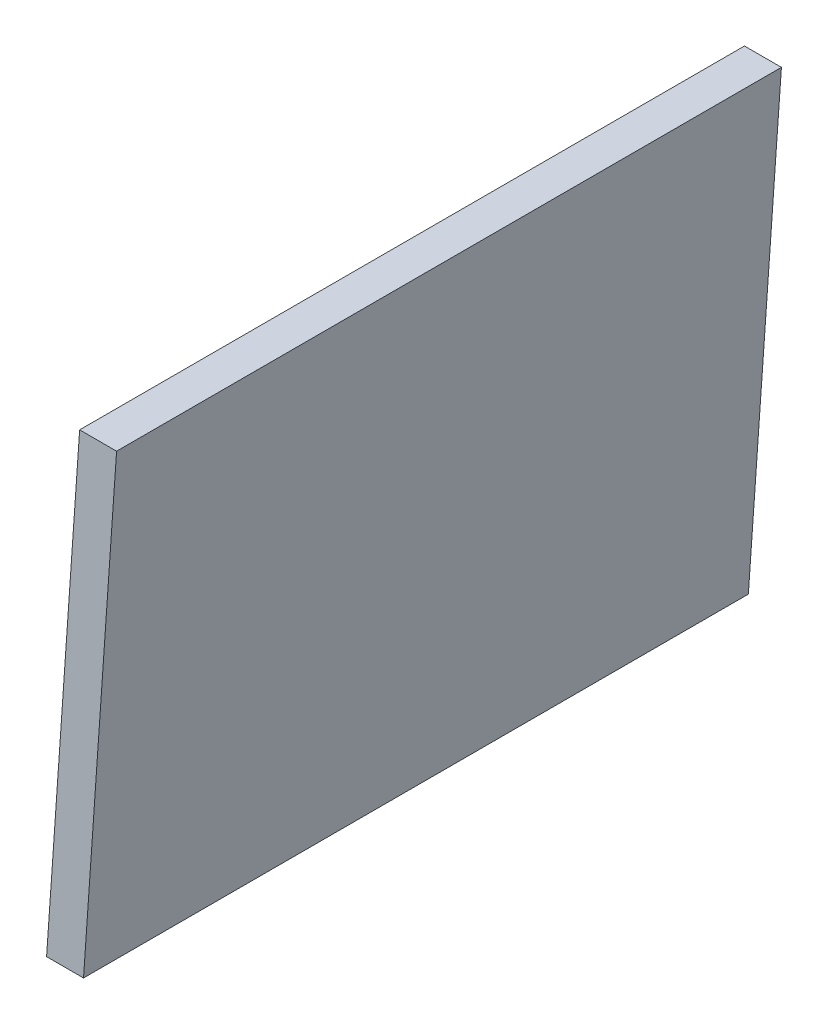
ISO-10303-21;
HEADER;
FILE_DESCRIPTION(('STEP AP214'),'2;1');
FILE_NAME('part.step','',(''),(''),'','','');
FILE_SCHEMA(('AUTOMOTIVE_DESIGN { 1 0 10303 214 1 1 1 1 }'));
ENDSEC;
DATA;
#1=APPLICATION_CONTEXT('core data for automotive mechanical design processes');
#2=APPLICATION_PROTOCOL_DEFINITION('international standard','automotive_design',2000,#1);
#3=PRODUCT_CONTEXT('',#1,'mechanical');
#4=PRODUCT('Part','Part','',(#3));
#5=PRODUCT_RELATED_PRODUCT_CATEGORY('part','',(#4));
#6=PRODUCT_DEFINITION_FORMATION('','',#4);
#7=PRODUCT_DEFINITION_CONTEXT('part definition',#1,'design');
#8=PRODUCT_DEFINITION('design','',#6,#7);
#9=PRODUCT_DEFINITION_SHAPE('','',#8);
#10=(LENGTH_UNIT() NAMED_UNIT(*) SI_UNIT(.MILLI.,.METRE.));
#11=(NAMED_UNIT(*) PLANE_ANGLE_UNIT() SI_UNIT($,.RADIAN.));
#12=(NAMED_UNIT(*) SI_UNIT($,.STERADIAN.) SOLID_ANGLE_UNIT());
#13=UNCERTAINTY_MEASURE_WITH_UNIT(LENGTH_MEASURE(1.E-05),#10,'distance_accuracy_value','');
#14=(GEOMETRIC_REPRESENTATION_CONTEXT(3) GLOBAL_UNCERTAINTY_ASSIGNED_CONTEXT((#13)) GLOBAL_UNIT_ASSIGNED_CONTEXT((#10,
#11,#12)) REPRESENTATION_CONTEXT('',''));
#15=CARTESIAN_POINT('',(0.,0.,0.));
#16=DIRECTION('',(0.,0.,1.));
#17=DIRECTION('',(1.,0.,0.));
#18=AXIS2_PLACEMENT_3D('',#15,#16,#17);
#19=CARTESIAN_POINT('',(25.,0.,450.));
#20=DIRECTION('',(0.,1.,0.));
#21=DIRECTION('',(-1.,0.,0.));
#22=AXIS2_PLACEMENT_3D('',#19,#20,#21);
#23=PLANE('',#22);
#24=DIRECTION('',(1.,0.,0.));
#25=VECTOR('',#24,1.);
#26=CARTESIAN_POINT('',(25.,0.,0.));
#27=LINE('',#26,#25);
#28=CARTESIAN_POINT('',(0.,0.,0.));
#29=VERTEX_POINT('',#28);
#30=CARTESIAN_POINT('',(25.,0.,0.));
#31=VERTEX_POINT('',#30);
#32=EDGE_CURVE('E97',#29,#31,#27,.T.);
#33=ORIENTED_EDGE('',*,*,#32,.T.);
#34=DIRECTION('',(0.,0.,-1.));
#35=VECTOR('',#34,1.);
#36=CARTESIAN_POINT('',(25.,0.,450.));
#37=LINE('',#36,#35);
#38=CARTESIAN_POINT('',(25.,0.,450.));
#39=VERTEX_POINT('',#38);
#40=EDGE_CURVE('E11',#39,#31,#37,.T.);
#41=ORIENTED_EDGE('',*,*,#40,.F.);
#42=DIRECTION('',(1.,0.,0.));
#43=VECTOR('',#42,1.);
#44=CARTESIAN_POINT('',(25.,0.,450.));
#45=LINE('',#44,#43);
#46=CARTESIAN_POINT('',(0.,0.,450.));
#47=VERTEX_POINT('',#46);
#48=EDGE_CURVE('E85',#47,#39,#45,.T.);
#49=ORIENTED_EDGE('',*,*,#48,.F.);
#50=DIRECTION('',(0.,0.,-1.));
#51=VECTOR('',#50,1.);
#52=CARTESIAN_POINT('',(0.,0.,450.));
#53=LINE('',#52,#51);
#54=EDGE_CURVE('E93',#47,#29,#53,.T.);
#55=ORIENTED_EDGE('',*,*,#54,.T.);
#56=EDGE_LOOP('',(#33,#41,#49,#55));
#57=FACE_BOUND('',#56,.T.);
#58=ADVANCED_FACE('F34',(#57),#23,.F.);
#59=CARTESIAN_POINT('',(47.3765798219234,320.,450.));
#60=DIRECTION('',(-0.997564050259824,0.0697564737441255,0.));
#61=DIRECTION('',(-0.0697564737441255,-0.997564050259824,0.));
#62=AXIS2_PLACEMENT_3D('',#59,#60,#61);
#63=PLANE('',#62);
#64=DIRECTION('',(0.0697564737441255,0.997564050259824,0.));
#65=VECTOR('',#64,1.);
#66=CARTESIAN_POINT('',(47.3765798219234,320.,0.));
#67=LINE('',#66,#65);
#68=CARTESIAN_POINT('',(47.3765798219234,320.,0.));
#69=VERTEX_POINT('',#68);
#70=EDGE_CURVE('E89',#31,#69,#67,.T.);
#71=ORIENTED_EDGE('',*,*,#70,.T.);
#72=DIRECTION('',(0.,0.,-1.));
#73=VECTOR('',#72,1.);
#74=CARTESIAN_POINT('',(47.3765798219234,320.,450.));
#75=LINE('',#74,#73);
#76=CARTESIAN_POINT('',(47.3765798219234,320.,450.));
#77=VERTEX_POINT('',#76);
#78=EDGE_CURVE('E42',#77,#69,#75,.T.);
#79=ORIENTED_EDGE('',*,*,#78,.F.);
#80=DIRECTION('',(0.0697564737441255,0.997564050259824,0.));
#81=VECTOR('',#80,1.);
#82=CARTESIAN_POINT('',(47.3765798219234,320.,450.));
#83=LINE('',#82,#81);
#84=EDGE_CURVE('E80',#39,#77,#83,.T.);
#85=ORIENTED_EDGE('',*,*,#84,.F.);
#86=ORIENTED_EDGE('',*,*,#40,.T.);
#87=EDGE_LOOP('',(#71,#79,#85,#86));
#88=FACE_BOUND('',#87,.T.);
#89=ADVANCED_FACE('F88',(#88),#63,.F.);
#90=CARTESIAN_POINT('',(22.3765798219234,320.,450.));
#91=DIRECTION('',(0.,-1.,0.));
#92=DIRECTION('',(0.,0.,-1.));
#93=AXIS2_PLACEMENT_3D('',#90,#91,#92);
#94=PLANE('',#93);
#95=DIRECTION('',(-1.,0.,0.));
#96=VECTOR('',#95,1.);
#97=CARTESIAN_POINT('',(22.3765798219234,320.,0.));
#98=LINE('',#97,#96);
#99=CARTESIAN_POINT('',(22.3765798219234,320.,0.));
#100=VERTEX_POINT('',#99);
#101=EDGE_CURVE('E67',#69,#100,#98,.T.);
#102=ORIENTED_EDGE('',*,*,#101,.T.);
#103=DIRECTION('',(0.,0.,-1.));
#104=VECTOR('',#103,1.);
#105=CARTESIAN_POINT('',(22.3765798219234,320.,450.));
#106=LINE('',#105,#104);
#107=CARTESIAN_POINT('',(22.3765798219234,320.,450.));
#108=VERTEX_POINT('',#107);
#109=EDGE_CURVE('E90',#108,#100,#106,.T.);
#110=ORIENTED_EDGE('',*,*,#109,.F.);
#111=DIRECTION('',(-1.,0.,0.));
#112=VECTOR('',#111,1.);
#113=CARTESIAN_POINT('',(22.3765798219234,320.,450.));
#114=LINE('',#113,#112);
#115=EDGE_CURVE('E83',#77,#108,#114,.T.);
#116=ORIENTED_EDGE('',*,*,#115,.F.);
#117=ORIENTED_EDGE('',*,*,#78,.T.);
#118=EDGE_LOOP('',(#102,#110,#116,#117));
#119=FACE_BOUND('',#118,.T.);
#120=ADVANCED_FACE('F91',(#119),#94,.F.);
#121=CARTESIAN_POINT('',(0.,0.,450.));
#122=DIRECTION('',(0.997564050259824,-0.0697564737441255,0.));
#123=DIRECTION('',(0.0697564737441255,0.997564050259824,0.));
#124=AXIS2_PLACEMENT_3D('',#121,#122,#123);
#125=PLANE('',#124);
#126=DIRECTION('',(-0.0697564737441255,-0.997564050259824,0.));
#127=VECTOR('',#126,1.);
#128=CARTESIAN_POINT('',(0.,0.,0.));
#129=LINE('',#128,#127);
#130=EDGE_CURVE('E73',#100,#29,#129,.T.);
#131=ORIENTED_EDGE('',*,*,#130,.T.);
#132=ORIENTED_EDGE('',*,*,#54,.F.);
#133=DIRECTION('',(-0.0697564737441255,-0.997564050259824,0.));
#134=VECTOR('',#133,1.);
#135=CARTESIAN_POINT('',(0.,0.,450.));
#136=LINE('',#135,#134);
#137=EDGE_CURVE('E50',#108,#47,#136,.T.);
#138=ORIENTED_EDGE('',*,*,#137,.F.);
#139=ORIENTED_EDGE('',*,*,#109,.T.);
#140=EDGE_LOOP('',(#131,#132,#138,#139));
#141=FACE_BOUND('',#140,.T.);
#142=ADVANCED_FACE('F104',(#141),#125,.F.);
#143=CARTESIAN_POINT('',(0.,0.,450.));
#144=DIRECTION('',(0.,0.,-1.));
#145=DIRECTION('',(-1.,0.,0.));
#146=AXIS2_PLACEMENT_3D('',#143,#144,#145);
#147=PLANE('',#146);
#148=ORIENTED_EDGE('',*,*,#48,.T.);
#149=ORIENTED_EDGE('',*,*,#84,.T.);
#150=ORIENTED_EDGE('',*,*,#115,.T.);
#151=ORIENTED_EDGE('',*,*,#137,.T.);
#152=EDGE_LOOP('',(#148,#149,#150,#151));
#153=FACE_BOUND('',#152,.T.);
#154=ADVANCED_FACE('F81',(#153),#147,.F.);
#155=CARTESIAN_POINT('',(0.,0.,0.));
#156=DIRECTION('',(0.,0.,-1.));
#157=DIRECTION('',(-1.,0.,0.));
#158=AXIS2_PLACEMENT_3D('',#155,#156,#157);
#159=PLANE('',#158);
#160=ORIENTED_EDGE('',*,*,#32,.F.);
#161=ORIENTED_EDGE('',*,*,#130,.F.);
#162=ORIENTED_EDGE('',*,*,#101,.F.);
#163=ORIENTED_EDGE('',*,*,#70,.F.);
#164=EDGE_LOOP('',(#160,#161,#162,#163));
#165=FACE_BOUND('',#164,.T.);
#166=ADVANCED_FACE('F107',(#165),#159,.T.);
#167=CLOSED_SHELL('',(#58,#89,#120,#142,#154,#166));
#168=MANIFOLD_SOLID_BREP('B2',#167);
#169=ADVANCED_BREP_SHAPE_REPRESENTATION('',(#18,#168),#14);
#170=SHAPE_DEFINITION_REPRESENTATION(#9,#169);
ENDSEC;
END-ISO-10303-21;
